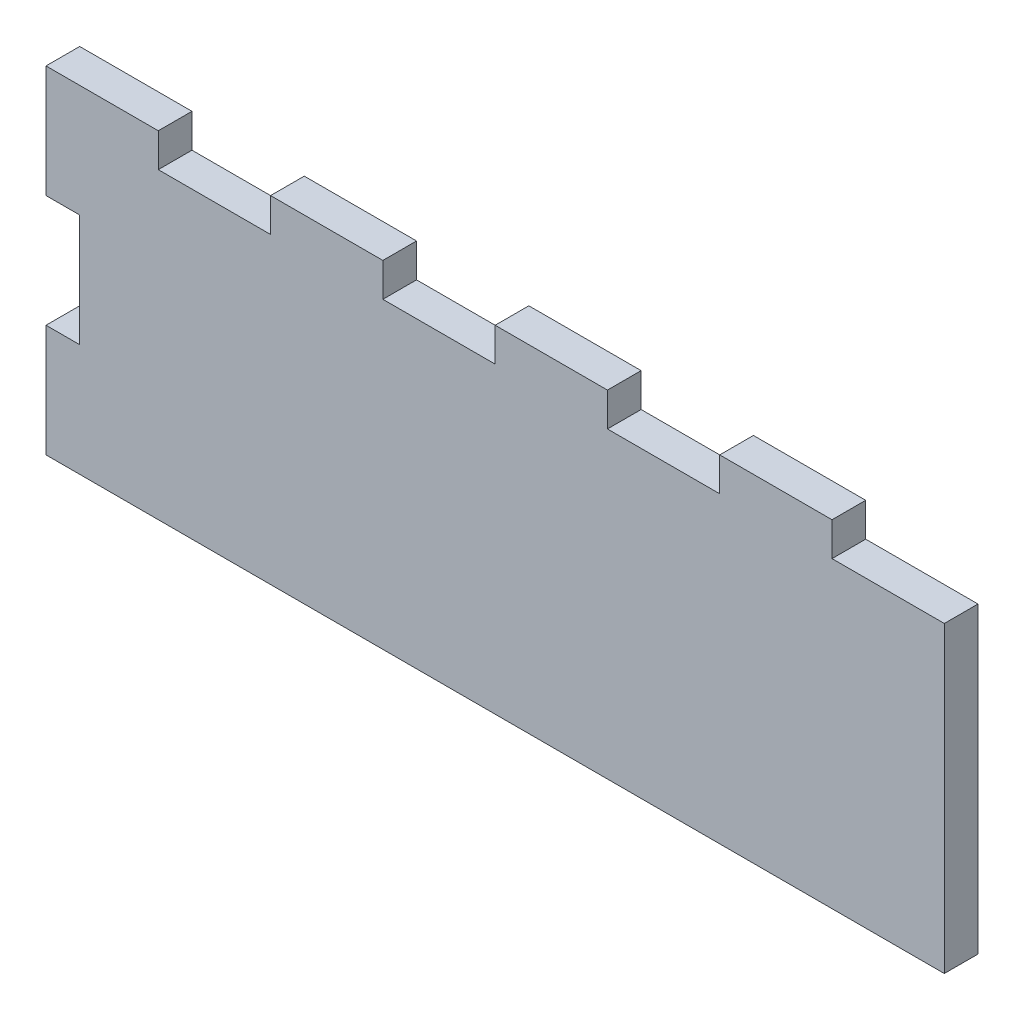
ISO-10303-21;
HEADER;
FILE_DESCRIPTION(('STEP AP214'),'2;1');
FILE_NAME('part.step','',(''),(''),'','','');
FILE_SCHEMA(('AUTOMOTIVE_DESIGN { 1 0 10303 214 1 1 1 1 }'));
ENDSEC;
DATA;
#1=APPLICATION_CONTEXT('core data for automotive mechanical design processes');
#2=APPLICATION_PROTOCOL_DEFINITION('international standard','automotive_design',2000,#1);
#3=PRODUCT_CONTEXT('',#1,'mechanical');
#4=PRODUCT('Part','Part','',(#3));
#5=PRODUCT_RELATED_PRODUCT_CATEGORY('part','',(#4));
#6=PRODUCT_DEFINITION_FORMATION('','',#4);
#7=PRODUCT_DEFINITION_CONTEXT('part definition',#1,'design');
#8=PRODUCT_DEFINITION('design','',#6,#7);
#9=PRODUCT_DEFINITION_SHAPE('','',#8);
#10=(LENGTH_UNIT() NAMED_UNIT(*) SI_UNIT(.MILLI.,.METRE.));
#11=(NAMED_UNIT(*) PLANE_ANGLE_UNIT() SI_UNIT($,.RADIAN.));
#12=(NAMED_UNIT(*) SI_UNIT($,.STERADIAN.) SOLID_ANGLE_UNIT());
#13=UNCERTAINTY_MEASURE_WITH_UNIT(LENGTH_MEASURE(1.E-05),#10,'distance_accuracy_value','');
#14=(GEOMETRIC_REPRESENTATION_CONTEXT(3) GLOBAL_UNCERTAINTY_ASSIGNED_CONTEXT((#13)) GLOBAL_UNIT_ASSIGNED_CONTEXT((#10,
#11,#12)) REPRESENTATION_CONTEXT('',''));
#15=CARTESIAN_POINT('',(0.,0.,0.));
#16=DIRECTION('',(0.,0.,1.));
#17=DIRECTION('',(1.,0.,0.));
#18=AXIS2_PLACEMENT_3D('',#15,#16,#17);
#19=CARTESIAN_POINT('',(0.,0.,3.));
#20=DIRECTION('',(1.,0.,0.));
#21=DIRECTION('',(0.,1.,0.));
#22=AXIS2_PLACEMENT_3D('',#19,#20,#21);
#23=PLANE('',#22);
#24=DIRECTION('',(0.,-1.,0.));
#25=VECTOR('',#24,1.);
#26=CARTESIAN_POINT('',(0.,0.,3.));
#27=LINE('',#26,#25);
#28=CARTESIAN_POINT('',(0.,-20.,3.));
#29=VERTEX_POINT('',#28);
#30=CARTESIAN_POINT('',(0.,-30.,3.));
#31=VERTEX_POINT('',#30);
#32=EDGE_CURVE('E207',#29,#31,#27,.T.);
#33=ORIENTED_EDGE('',*,*,#32,.F.);
#34=DIRECTION('',(0.,0.,-1.));
#35=VECTOR('',#34,1.);
#36=CARTESIAN_POINT('',(0.,-20.,3.));
#37=LINE('',#36,#35);
#38=CARTESIAN_POINT('',(0.,-20.,0.));
#39=VERTEX_POINT('',#38);
#40=EDGE_CURVE('E278',#29,#39,#37,.T.);
#41=ORIENTED_EDGE('',*,*,#40,.T.);
#42=DIRECTION('',(0.,-1.,0.));
#43=VECTOR('',#42,1.);
#44=CARTESIAN_POINT('',(0.,0.,0.));
#45=LINE('',#44,#43);
#46=CARTESIAN_POINT('',(0.,-30.,0.));
#47=VERTEX_POINT('',#46);
#48=EDGE_CURVE('E225',#39,#47,#45,.T.);
#49=ORIENTED_EDGE('',*,*,#48,.T.);
#50=DIRECTION('',(0.,0.,-1.));
#51=VECTOR('',#50,1.);
#52=CARTESIAN_POINT('',(0.,-30.,3.));
#53=LINE('',#52,#51);
#54=EDGE_CURVE('E11',#31,#47,#53,.T.);
#55=ORIENTED_EDGE('',*,*,#54,.F.);
#56=EDGE_LOOP('',(#33,#41,#49,#55));
#57=FACE_BOUND('',#56,.T.);
#58=ADVANCED_FACE('F33',(#57),#23,.F.);
#59=CARTESIAN_POINT('',(0.,0.,3.));
#60=DIRECTION('',(0.,-1.,0.));
#61=DIRECTION('',(0.,0.,-1.));
#62=AXIS2_PLACEMENT_3D('',#59,#60,#61);
#63=PLANE('',#62);
#64=DIRECTION('',(-1.,0.,0.));
#65=VECTOR('',#64,1.);
#66=CARTESIAN_POINT('',(0.,0.,0.));
#67=LINE('',#66,#65);
#68=CARTESIAN_POINT('',(70.,0.,0.));
#69=VERTEX_POINT('',#68);
#70=CARTESIAN_POINT('',(60.,0.,0.));
#71=VERTEX_POINT('',#70);
#72=EDGE_CURVE('E211',#69,#71,#67,.T.);
#73=ORIENTED_EDGE('',*,*,#72,.T.);
#74=DIRECTION('',(0.,0.,1.));
#75=VECTOR('',#74,1.);
#76=CARTESIAN_POINT('',(60.,0.,0.));
#77=LINE('',#76,#75);
#78=CARTESIAN_POINT('',(60.,0.,3.));
#79=VERTEX_POINT('',#78);
#80=EDGE_CURVE('E302',#71,#79,#77,.T.);
#81=ORIENTED_EDGE('',*,*,#80,.T.);
#82=DIRECTION('',(-1.,0.,0.));
#83=VECTOR('',#82,1.);
#84=CARTESIAN_POINT('',(0.,0.,3.));
#85=LINE('',#84,#83);
#86=CARTESIAN_POINT('',(70.,0.,3.));
#87=VERTEX_POINT('',#86);
#88=EDGE_CURVE('E218',#87,#79,#85,.T.);
#89=ORIENTED_EDGE('',*,*,#88,.F.);
#90=DIRECTION('',(0.,0.,1.));
#91=VECTOR('',#90,1.);
#92=CARTESIAN_POINT('',(70.,0.,0.));
#93=LINE('',#92,#91);
#94=EDGE_CURVE('E213',#69,#87,#93,.T.);
#95=ORIENTED_EDGE('',*,*,#94,.F.);
#96=EDGE_LOOP('',(#73,#81,#89,#95));
#97=FACE_BOUND('',#96,.T.);
#98=ADVANCED_FACE('F422',(#97),#63,.F.);
#99=CARTESIAN_POINT('',(50.,0.,3.));
#100=VERTEX_POINT('',#99);
#101=CARTESIAN_POINT('',(40.,0.,3.));
#102=VERTEX_POINT('',#101);
#103=EDGE_CURVE('E222',#100,#102,#85,.T.);
#104=ORIENTED_EDGE('',*,*,#103,.F.);
#105=DIRECTION('',(0.,0.,1.));
#106=VECTOR('',#105,1.);
#107=CARTESIAN_POINT('',(50.,0.,0.));
#108=LINE('',#107,#106);
#109=CARTESIAN_POINT('',(50.,0.,0.));
#110=VERTEX_POINT('',#109);
#111=EDGE_CURVE('E314',#110,#100,#108,.T.);
#112=ORIENTED_EDGE('',*,*,#111,.F.);
#113=CARTESIAN_POINT('',(40.,0.,0.));
#114=VERTEX_POINT('',#113);
#115=EDGE_CURVE('E233',#110,#114,#67,.T.);
#116=ORIENTED_EDGE('',*,*,#115,.T.);
#117=DIRECTION('',(0.,0.,1.));
#118=VECTOR('',#117,1.);
#119=CARTESIAN_POINT('',(40.,0.,0.));
#120=LINE('',#119,#118);
#121=EDGE_CURVE('E328',#114,#102,#120,.T.);
#122=ORIENTED_EDGE('',*,*,#121,.T.);
#123=EDGE_LOOP('',(#104,#112,#116,#122));
#124=FACE_BOUND('',#123,.T.);
#125=ADVANCED_FACE('F388',(#124),#63,.F.);
#126=CARTESIAN_POINT('',(30.,0.,3.));
#127=VERTEX_POINT('',#126);
#128=CARTESIAN_POINT('',(20.,0.,3.));
#129=VERTEX_POINT('',#128);
#130=EDGE_CURVE('E372',#127,#129,#85,.T.);
#131=ORIENTED_EDGE('',*,*,#130,.F.);
#132=DIRECTION('',(0.,0.,1.));
#133=VECTOR('',#132,1.);
#134=CARTESIAN_POINT('',(30.,0.,0.));
#135=LINE('',#134,#133);
#136=CARTESIAN_POINT('',(30.,0.,0.));
#137=VERTEX_POINT('',#136);
#138=EDGE_CURVE('E340',#137,#127,#135,.T.);
#139=ORIENTED_EDGE('',*,*,#138,.F.);
#140=CARTESIAN_POINT('',(20.,0.,0.));
#141=VERTEX_POINT('',#140);
#142=EDGE_CURVE('E374',#137,#141,#67,.T.);
#143=ORIENTED_EDGE('',*,*,#142,.T.);
#144=DIRECTION('',(0.,0.,1.));
#145=VECTOR('',#144,1.);
#146=CARTESIAN_POINT('',(20.,0.,0.));
#147=LINE('',#146,#145);
#148=EDGE_CURVE('E354',#141,#129,#147,.T.);
#149=ORIENTED_EDGE('',*,*,#148,.T.);
#150=EDGE_LOOP('',(#131,#139,#143,#149));
#151=FACE_BOUND('',#150,.T.);
#152=ADVANCED_FACE('F370',(#151),#63,.F.);
#153=CARTESIAN_POINT('',(0.,0.,0.));
#154=VERTEX_POINT('',#153);
#155=CARTESIAN_POINT('',(0.,-10.,0.));
#156=VERTEX_POINT('',#155);
#157=EDGE_CURVE('E197',#154,#156,#45,.T.);
#158=ORIENTED_EDGE('',*,*,#157,.T.);
#159=DIRECTION('',(0.,0.,-1.));
#160=VECTOR('',#159,1.);
#161=CARTESIAN_POINT('',(0.,-10.,3.));
#162=LINE('',#161,#160);
#163=CARTESIAN_POINT('',(0.,-10.,3.));
#164=VERTEX_POINT('',#163);
#165=EDGE_CURVE('E48',#164,#156,#162,.T.);
#166=ORIENTED_EDGE('',*,*,#165,.F.);
#167=CARTESIAN_POINT('',(0.,0.,3.));
#168=VERTEX_POINT('',#167);
#169=EDGE_CURVE('E195',#168,#164,#27,.T.);
#170=ORIENTED_EDGE('',*,*,#169,.F.);
#171=DIRECTION('',(0.,0.,-1.));
#172=VECTOR('',#171,1.);
#173=CARTESIAN_POINT('',(0.,0.,3.));
#174=LINE('',#173,#172);
#175=EDGE_CURVE('E221',#168,#154,#174,.T.);
#176=ORIENTED_EDGE('',*,*,#175,.T.);
#177=EDGE_LOOP('',(#158,#166,#170,#176));
#178=FACE_BOUND('',#177,.T.);
#179=ADVANCED_FACE('F35',(#178),#23,.F.);
#180=CARTESIAN_POINT('',(0.,-30.,3.));
#181=DIRECTION('',(0.,1.,0.));
#182=DIRECTION('',(0.,0.,1.));
#183=AXIS2_PLACEMENT_3D('',#180,#181,#182);
#184=PLANE('',#183);
#185=DIRECTION('',(1.,0.,0.));
#186=VECTOR('',#185,1.);
#187=CARTESIAN_POINT('',(0.,-30.,0.));
#188=LINE('',#187,#186);
#189=CARTESIAN_POINT('',(80.,-30.,0.));
#190=VERTEX_POINT('',#189);
#191=EDGE_CURVE('E224',#47,#190,#188,.T.);
#192=ORIENTED_EDGE('',*,*,#191,.T.);
#193=DIRECTION('',(0.,0.,-1.));
#194=VECTOR('',#193,1.);
#195=CARTESIAN_POINT('',(80.,-30.,3.));
#196=LINE('',#195,#194);
#197=CARTESIAN_POINT('',(80.,-30.,3.));
#198=VERTEX_POINT('',#197);
#199=EDGE_CURVE('E41',#198,#190,#196,.T.);
#200=ORIENTED_EDGE('',*,*,#199,.F.);
#201=DIRECTION('',(1.,0.,0.));
#202=VECTOR('',#201,1.);
#203=CARTESIAN_POINT('',(0.,-30.,3.));
#204=LINE('',#203,#202);
#205=EDGE_CURVE('E206',#31,#198,#204,.T.);
#206=ORIENTED_EDGE('',*,*,#205,.F.);
#207=ORIENTED_EDGE('',*,*,#54,.T.);
#208=EDGE_LOOP('',(#192,#200,#206,#207));
#209=FACE_BOUND('',#208,.T.);
#210=ADVANCED_FACE('F275',(#209),#184,.F.);
#211=CARTESIAN_POINT('',(80.,0.,3.));
#212=DIRECTION('',(-1.,0.,0.));
#213=DIRECTION('',(0.,0.,1.));
#214=AXIS2_PLACEMENT_3D('',#211,#212,#213);
#215=PLANE('',#214);
#216=DIRECTION('',(0.,1.,0.));
#217=VECTOR('',#216,1.);
#218=CARTESIAN_POINT('',(80.,0.,0.));
#219=LINE('',#218,#217);
#220=CARTESIAN_POINT('',(80.,-3.,0.));
#221=VERTEX_POINT('',#220);
#222=EDGE_CURVE('E227',#190,#221,#219,.T.);
#223=ORIENTED_EDGE('',*,*,#222,.T.);
#224=DIRECTION('',(0.,0.,1.));
#225=VECTOR('',#224,1.);
#226=CARTESIAN_POINT('',(80.,-3.,0.));
#227=LINE('',#226,#225);
#228=CARTESIAN_POINT('',(80.,-3.,3.));
#229=VERTEX_POINT('',#228);
#230=EDGE_CURVE('E265',#221,#229,#227,.T.);
#231=ORIENTED_EDGE('',*,*,#230,.T.);
#232=DIRECTION('',(0.,1.,0.));
#233=VECTOR('',#232,1.);
#234=CARTESIAN_POINT('',(80.,0.,3.));
#235=LINE('',#234,#233);
#236=EDGE_CURVE('E209',#198,#229,#235,.T.);
#237=ORIENTED_EDGE('',*,*,#236,.F.);
#238=ORIENTED_EDGE('',*,*,#199,.T.);
#239=EDGE_LOOP('',(#223,#231,#237,#238));
#240=FACE_BOUND('',#239,.T.);
#241=ADVANCED_FACE('F239',(#240),#215,.F.);
#242=CARTESIAN_POINT('',(10.,0.,3.));
#243=VERTEX_POINT('',#242);
#244=EDGE_CURVE('E204',#243,#168,#85,.T.);
#245=ORIENTED_EDGE('',*,*,#244,.F.);
#246=DIRECTION('',(0.,0.,1.));
#247=VECTOR('',#246,1.);
#248=CARTESIAN_POINT('',(10.,0.,0.));
#249=LINE('',#248,#247);
#250=CARTESIAN_POINT('',(10.,0.,0.));
#251=VERTEX_POINT('',#250);
#252=EDGE_CURVE('E364',#251,#243,#249,.T.);
#253=ORIENTED_EDGE('',*,*,#252,.F.);
#254=EDGE_CURVE('E230',#251,#154,#67,.T.);
#255=ORIENTED_EDGE('',*,*,#254,.T.);
#256=ORIENTED_EDGE('',*,*,#175,.F.);
#257=EDGE_LOOP('',(#245,#253,#255,#256));
#258=FACE_BOUND('',#257,.T.);
#259=ADVANCED_FACE('F402',(#258),#63,.F.);
#260=CARTESIAN_POINT('',(0.,0.,3.));
#261=DIRECTION('',(0.,0.,1.));
#262=DIRECTION('',(1.,0.,0.));
#263=AXIS2_PLACEMENT_3D('',#260,#261,#262);
#264=PLANE('',#263);
#265=DIRECTION('',(-1.,0.,0.));
#266=VECTOR('',#265,1.);
#267=CARTESIAN_POINT('',(0.,-20.,3.));
#268=LINE('',#267,#266);
#269=CARTESIAN_POINT('',(3.,-20.,3.));
#270=VERTEX_POINT('',#269);
#271=EDGE_CURVE('E198',#270,#29,#268,.T.);
#272=ORIENTED_EDGE('',*,*,#271,.T.);
#273=ORIENTED_EDGE('',*,*,#32,.T.);
#274=ORIENTED_EDGE('',*,*,#205,.T.);
#275=ORIENTED_EDGE('',*,*,#236,.T.);
#276=DIRECTION('',(1.,0.,0.));
#277=VECTOR('',#276,1.);
#278=CARTESIAN_POINT('',(80.,-3.,3.));
#279=LINE('',#278,#277);
#280=CARTESIAN_POINT('',(70.,-3.,3.));
#281=VERTEX_POINT('',#280);
#282=EDGE_CURVE('E256',#281,#229,#279,.T.);
#283=ORIENTED_EDGE('',*,*,#282,.F.);
#284=DIRECTION('',(0.,-1.,0.));
#285=VECTOR('',#284,1.);
#286=CARTESIAN_POINT('',(70.,0.,3.));
#287=LINE('',#286,#285);
#288=EDGE_CURVE('E260',#87,#281,#287,.T.);
#289=ORIENTED_EDGE('',*,*,#288,.F.);
#290=ORIENTED_EDGE('',*,*,#88,.T.);
#291=DIRECTION('',(0.,1.,0.));
#292=VECTOR('',#291,1.);
#293=CARTESIAN_POINT('',(60.,0.,3.));
#294=LINE('',#293,#292);
#295=CARTESIAN_POINT('',(60.,-3.,3.));
#296=VERTEX_POINT('',#295);
#297=EDGE_CURVE('E303',#296,#79,#294,.T.);
#298=ORIENTED_EDGE('',*,*,#297,.F.);
#299=DIRECTION('',(1.,0.,0.));
#300=VECTOR('',#299,1.);
#301=CARTESIAN_POINT('',(60.,-3.,3.));
#302=LINE('',#301,#300);
#303=CARTESIAN_POINT('',(50.,-3.,3.));
#304=VERTEX_POINT('',#303);
#305=EDGE_CURVE('E298',#304,#296,#302,.T.);
#306=ORIENTED_EDGE('',*,*,#305,.F.);
#307=DIRECTION('',(0.,-1.,0.));
#308=VECTOR('',#307,1.);
#309=CARTESIAN_POINT('',(50.,0.,3.));
#310=LINE('',#309,#308);
#311=EDGE_CURVE('E305',#100,#304,#310,.T.);
#312=ORIENTED_EDGE('',*,*,#311,.F.);
#313=ORIENTED_EDGE('',*,*,#103,.T.);
#314=DIRECTION('',(0.,1.,0.));
#315=VECTOR('',#314,1.);
#316=CARTESIAN_POINT('',(40.,0.,3.));
#317=LINE('',#316,#315);
#318=CARTESIAN_POINT('',(40.,-3.,3.));
#319=VERTEX_POINT('',#318);
#320=EDGE_CURVE('E329',#319,#102,#317,.T.);
#321=ORIENTED_EDGE('',*,*,#320,.F.);
#322=DIRECTION('',(1.,0.,0.));
#323=VECTOR('',#322,1.);
#324=CARTESIAN_POINT('',(40.,-3.,3.));
#325=LINE('',#324,#323);
#326=CARTESIAN_POINT('',(30.,-3.,3.));
#327=VERTEX_POINT('',#326);
#328=EDGE_CURVE('E322',#327,#319,#325,.T.);
#329=ORIENTED_EDGE('',*,*,#328,.F.);
#330=DIRECTION('',(0.,-1.,0.));
#331=VECTOR('',#330,1.);
#332=CARTESIAN_POINT('',(30.,0.,3.));
#333=LINE('',#332,#331);
#334=EDGE_CURVE('E331',#127,#327,#333,.T.);
#335=ORIENTED_EDGE('',*,*,#334,.F.);
#336=ORIENTED_EDGE('',*,*,#130,.T.);
#337=DIRECTION('',(0.,1.,0.));
#338=VECTOR('',#337,1.);
#339=CARTESIAN_POINT('',(20.,0.,3.));
#340=LINE('',#339,#338);
#341=CARTESIAN_POINT('',(20.,-3.,3.));
#342=VERTEX_POINT('',#341);
#343=EDGE_CURVE('E290',#342,#129,#340,.T.);
#344=ORIENTED_EDGE('',*,*,#343,.F.);
#345=DIRECTION('',(1.,0.,0.));
#346=VECTOR('',#345,1.);
#347=CARTESIAN_POINT('',(20.,-3.,3.));
#348=LINE('',#347,#346);
#349=CARTESIAN_POINT('',(10.,-3.,3.));
#350=VERTEX_POINT('',#349);
#351=EDGE_CURVE('E348',#350,#342,#348,.T.);
#352=ORIENTED_EDGE('',*,*,#351,.F.);
#353=DIRECTION('',(0.,-1.,0.));
#354=VECTOR('',#353,1.);
#355=CARTESIAN_POINT('',(10.,0.,3.));
#356=LINE('',#355,#354);
#357=EDGE_CURVE('E356',#243,#350,#356,.T.);
#358=ORIENTED_EDGE('',*,*,#357,.F.);
#359=ORIENTED_EDGE('',*,*,#244,.T.);
#360=ORIENTED_EDGE('',*,*,#169,.T.);
#361=DIRECTION('',(1.,0.,0.));
#362=VECTOR('',#361,1.);
#363=CARTESIAN_POINT('',(0.,-10.,3.));
#364=LINE('',#363,#362);
#365=CARTESIAN_POINT('',(3.,-10.,3.));
#366=VERTEX_POINT('',#365);
#367=EDGE_CURVE('E181',#164,#366,#364,.T.);
#368=ORIENTED_EDGE('',*,*,#367,.T.);
#369=DIRECTION('',(0.,-1.,0.));
#370=VECTOR('',#369,1.);
#371=CARTESIAN_POINT('',(3.,-20.,3.));
#372=LINE('',#371,#370);
#373=EDGE_CURVE('E188',#366,#270,#372,.T.);
#374=ORIENTED_EDGE('',*,*,#373,.T.);
#375=EDGE_LOOP('',(#272,#273,#274,#275,#283,#289,#290,#298,#306,#312,#313,#321,#329,#335,#336,
#344,#352,#358,#359,#360,#368,#374));
#376=FACE_BOUND('',#375,.T.);
#377=ADVANCED_FACE('F201',(#376),#264,.T.);
#378=CARTESIAN_POINT('',(0.,0.,0.));
#379=DIRECTION('',(0.,0.,1.));
#380=DIRECTION('',(1.,0.,0.));
#381=AXIS2_PLACEMENT_3D('',#378,#379,#380);
#382=PLANE('',#381);
#383=ORIENTED_EDGE('',*,*,#48,.F.);
#384=DIRECTION('',(-1.,0.,0.));
#385=VECTOR('',#384,1.);
#386=CARTESIAN_POINT('',(0.,-20.,0.));
#387=LINE('',#386,#385);
#388=CARTESIAN_POINT('',(3.,-20.,0.));
#389=VERTEX_POINT('',#388);
#390=EDGE_CURVE('E189',#389,#39,#387,.T.);
#391=ORIENTED_EDGE('',*,*,#390,.F.);
#392=DIRECTION('',(0.,-1.,0.));
#393=VECTOR('',#392,1.);
#394=CARTESIAN_POINT('',(3.,-20.,0.));
#395=LINE('',#394,#393);
#396=CARTESIAN_POINT('',(3.,-10.,0.));
#397=VERTEX_POINT('',#396);
#398=EDGE_CURVE('E282',#397,#389,#395,.T.);
#399=ORIENTED_EDGE('',*,*,#398,.F.);
#400=DIRECTION('',(1.,0.,0.));
#401=VECTOR('',#400,1.);
#402=CARTESIAN_POINT('',(0.,-10.,0.));
#403=LINE('',#402,#401);
#404=EDGE_CURVE('E285',#156,#397,#403,.T.);
#405=ORIENTED_EDGE('',*,*,#404,.F.);
#406=ORIENTED_EDGE('',*,*,#157,.F.);
#407=ORIENTED_EDGE('',*,*,#254,.F.);
#408=DIRECTION('',(0.,-1.,0.));
#409=VECTOR('',#408,1.);
#410=CARTESIAN_POINT('',(10.,0.,0.));
#411=LINE('',#410,#409);
#412=CARTESIAN_POINT('',(10.,-3.,0.));
#413=VERTEX_POINT('',#412);
#414=EDGE_CURVE('E347',#251,#413,#411,.T.);
#415=ORIENTED_EDGE('',*,*,#414,.T.);
#416=DIRECTION('',(1.,0.,0.));
#417=VECTOR('',#416,1.);
#418=CARTESIAN_POINT('',(20.,-3.,0.));
#419=LINE('',#418,#417);
#420=CARTESIAN_POINT('',(20.,-3.,0.));
#421=VERTEX_POINT('',#420);
#422=EDGE_CURVE('E351',#413,#421,#419,.T.);
#423=ORIENTED_EDGE('',*,*,#422,.T.);
#424=DIRECTION('',(0.,1.,0.));
#425=VECTOR('',#424,1.);
#426=CARTESIAN_POINT('',(20.,0.,0.));
#427=LINE('',#426,#425);
#428=EDGE_CURVE('E344',#421,#141,#427,.T.);
#429=ORIENTED_EDGE('',*,*,#428,.T.);
#430=ORIENTED_EDGE('',*,*,#142,.F.);
#431=DIRECTION('',(0.,-1.,0.));
#432=VECTOR('',#431,1.);
#433=CARTESIAN_POINT('',(30.,0.,0.));
#434=LINE('',#433,#432);
#435=CARTESIAN_POINT('',(30.,-3.,0.));
#436=VERTEX_POINT('',#435);
#437=EDGE_CURVE('E321',#137,#436,#434,.T.);
#438=ORIENTED_EDGE('',*,*,#437,.T.);
#439=DIRECTION('',(1.,0.,0.));
#440=VECTOR('',#439,1.);
#441=CARTESIAN_POINT('',(40.,-3.,0.));
#442=LINE('',#441,#440);
#443=CARTESIAN_POINT('',(40.,-3.,0.));
#444=VERTEX_POINT('',#443);
#445=EDGE_CURVE('E325',#436,#444,#442,.T.);
#446=ORIENTED_EDGE('',*,*,#445,.T.);
#447=DIRECTION('',(0.,1.,0.));
#448=VECTOR('',#447,1.);
#449=CARTESIAN_POINT('',(40.,0.,0.));
#450=LINE('',#449,#448);
#451=EDGE_CURVE('E318',#444,#114,#450,.T.);
#452=ORIENTED_EDGE('',*,*,#451,.T.);
#453=ORIENTED_EDGE('',*,*,#115,.F.);
#454=DIRECTION('',(0.,-1.,0.));
#455=VECTOR('',#454,1.);
#456=CARTESIAN_POINT('',(50.,0.,0.));
#457=LINE('',#456,#455);
#458=CARTESIAN_POINT('',(50.,-3.,0.));
#459=VERTEX_POINT('',#458);
#460=EDGE_CURVE('E297',#110,#459,#457,.T.);
#461=ORIENTED_EDGE('',*,*,#460,.T.);
#462=DIRECTION('',(1.,0.,0.));
#463=VECTOR('',#462,1.);
#464=CARTESIAN_POINT('',(60.,-3.,0.));
#465=LINE('',#464,#463);
#466=CARTESIAN_POINT('',(60.,-3.,0.));
#467=VERTEX_POINT('',#466);
#468=EDGE_CURVE('E56',#459,#467,#465,.T.);
#469=ORIENTED_EDGE('',*,*,#468,.T.);
#470=DIRECTION('',(0.,1.,0.));
#471=VECTOR('',#470,1.);
#472=CARTESIAN_POINT('',(60.,0.,0.));
#473=LINE('',#472,#471);
#474=EDGE_CURVE('E294',#467,#71,#473,.T.);
#475=ORIENTED_EDGE('',*,*,#474,.T.);
#476=ORIENTED_EDGE('',*,*,#72,.F.);
#477=DIRECTION('',(0.,-1.,0.));
#478=VECTOR('',#477,1.);
#479=CARTESIAN_POINT('',(70.,0.,0.));
#480=LINE('',#479,#478);
#481=CARTESIAN_POINT('',(70.,-3.,0.));
#482=VERTEX_POINT('',#481);
#483=EDGE_CURVE('E251',#69,#482,#480,.T.);
#484=ORIENTED_EDGE('',*,*,#483,.T.);
#485=DIRECTION('',(1.,0.,0.));
#486=VECTOR('',#485,1.);
#487=CARTESIAN_POINT('',(80.,-3.,0.));
#488=LINE('',#487,#486);
#489=EDGE_CURVE('E249',#482,#221,#488,.T.);
#490=ORIENTED_EDGE('',*,*,#489,.T.);
#491=ORIENTED_EDGE('',*,*,#222,.F.);
#492=ORIENTED_EDGE('',*,*,#191,.F.);
#493=EDGE_LOOP('',(#383,#391,#399,#405,#406,#407,#415,#423,#429,#430,#438,#446,#452,#453,#461,
#469,#475,#476,#484,#490,#491,#492));
#494=FACE_BOUND('',#493,.T.);
#495=ADVANCED_FACE('F247',(#494),#382,.F.);
#496=CARTESIAN_POINT('',(80.,-3.,0.));
#497=DIRECTION('',(0.,-1.,0.));
#498=DIRECTION('',(1.,0.,0.));
#499=AXIS2_PLACEMENT_3D('',#496,#497,#498);
#500=PLANE('',#499);
#501=ORIENTED_EDGE('',*,*,#282,.T.);
#502=ORIENTED_EDGE('',*,*,#230,.F.);
#503=ORIENTED_EDGE('',*,*,#489,.F.);
#504=DIRECTION('',(0.,0.,1.));
#505=VECTOR('',#504,1.);
#506=CARTESIAN_POINT('',(70.,-3.,0.));
#507=LINE('',#506,#505);
#508=EDGE_CURVE('E255',#482,#281,#507,.T.);
#509=ORIENTED_EDGE('',*,*,#508,.T.);
#510=EDGE_LOOP('',(#501,#502,#503,#509));
#511=FACE_BOUND('',#510,.T.);
#512=ADVANCED_FACE('F266',(#511),#500,.F.);
#513=CARTESIAN_POINT('',(70.,0.,0.));
#514=DIRECTION('',(-1.,0.,0.));
#515=DIRECTION('',(0.,0.,1.));
#516=AXIS2_PLACEMENT_3D('',#513,#514,#515);
#517=PLANE('',#516);
#518=ORIENTED_EDGE('',*,*,#288,.T.);
#519=ORIENTED_EDGE('',*,*,#508,.F.);
#520=ORIENTED_EDGE('',*,*,#483,.F.);
#521=ORIENTED_EDGE('',*,*,#94,.T.);
#522=EDGE_LOOP('',(#518,#519,#520,#521));
#523=FACE_BOUND('',#522,.T.);
#524=ADVANCED_FACE('F270',(#523),#517,.F.);
#525=CARTESIAN_POINT('',(20.,0.,0.));
#526=DIRECTION('',(1.,0.,0.));
#527=DIRECTION('',(0.,0.,-1.));
#528=AXIS2_PLACEMENT_3D('',#525,#526,#527);
#529=PLANE('',#528);
#530=ORIENTED_EDGE('',*,*,#343,.T.);
#531=ORIENTED_EDGE('',*,*,#148,.F.);
#532=ORIENTED_EDGE('',*,*,#428,.F.);
#533=DIRECTION('',(0.,0.,1.));
#534=VECTOR('',#533,1.);
#535=CARTESIAN_POINT('',(20.,-3.,0.));
#536=LINE('',#535,#534);
#537=EDGE_CURVE('E332',#421,#342,#536,.T.);
#538=ORIENTED_EDGE('',*,*,#537,.T.);
#539=EDGE_LOOP('',(#530,#531,#532,#538));
#540=FACE_BOUND('',#539,.T.);
#541=ADVANCED_FACE('F490',(#540),#529,.F.);
#542=CARTESIAN_POINT('',(20.,-3.,0.));
#543=DIRECTION('',(0.,-1.,0.));
#544=DIRECTION('',(1.,0.,0.));
#545=AXIS2_PLACEMENT_3D('',#542,#543,#544);
#546=PLANE('',#545);
#547=ORIENTED_EDGE('',*,*,#351,.T.);
#548=ORIENTED_EDGE('',*,*,#537,.F.);
#549=ORIENTED_EDGE('',*,*,#422,.F.);
#550=DIRECTION('',(0.,0.,1.));
#551=VECTOR('',#550,1.);
#552=CARTESIAN_POINT('',(10.,-3.,0.));
#553=LINE('',#552,#551);
#554=EDGE_CURVE('E362',#413,#350,#553,.T.);
#555=ORIENTED_EDGE('',*,*,#554,.T.);
#556=EDGE_LOOP('',(#547,#548,#549,#555));
#557=FACE_BOUND('',#556,.T.);
#558=ADVANCED_FACE('F511',(#557),#546,.F.);
#559=CARTESIAN_POINT('',(10.,0.,0.));
#560=DIRECTION('',(-1.,0.,0.));
#561=DIRECTION('',(0.,0.,1.));
#562=AXIS2_PLACEMENT_3D('',#559,#560,#561);
#563=PLANE('',#562);
#564=ORIENTED_EDGE('',*,*,#357,.T.);
#565=ORIENTED_EDGE('',*,*,#554,.F.);
#566=ORIENTED_EDGE('',*,*,#414,.F.);
#567=ORIENTED_EDGE('',*,*,#252,.T.);
#568=EDGE_LOOP('',(#564,#565,#566,#567));
#569=FACE_BOUND('',#568,.T.);
#570=ADVANCED_FACE('F519',(#569),#563,.F.);
#571=CARTESIAN_POINT('',(40.,0.,0.));
#572=DIRECTION('',(1.,0.,0.));
#573=DIRECTION('',(0.,0.,-1.));
#574=AXIS2_PLACEMENT_3D('',#571,#572,#573);
#575=PLANE('',#574);
#576=ORIENTED_EDGE('',*,*,#320,.T.);
#577=ORIENTED_EDGE('',*,*,#121,.F.);
#578=ORIENTED_EDGE('',*,*,#451,.F.);
#579=DIRECTION('',(0.,0.,1.));
#580=VECTOR('',#579,1.);
#581=CARTESIAN_POINT('',(40.,-3.,0.));
#582=LINE('',#581,#580);
#583=EDGE_CURVE('E306',#444,#319,#582,.T.);
#584=ORIENTED_EDGE('',*,*,#583,.T.);
#585=EDGE_LOOP('',(#576,#577,#578,#584));
#586=FACE_BOUND('',#585,.T.);
#587=ADVANCED_FACE('F393',(#586),#575,.F.);
#588=CARTESIAN_POINT('',(40.,-3.,0.));
#589=DIRECTION('',(0.,-1.,0.));
#590=DIRECTION('',(1.,0.,0.));
#591=AXIS2_PLACEMENT_3D('',#588,#589,#590);
#592=PLANE('',#591);
#593=ORIENTED_EDGE('',*,*,#328,.T.);
#594=ORIENTED_EDGE('',*,*,#583,.F.);
#595=ORIENTED_EDGE('',*,*,#445,.F.);
#596=DIRECTION('',(0.,0.,1.));
#597=VECTOR('',#596,1.);
#598=CARTESIAN_POINT('',(30.,-3.,0.));
#599=LINE('',#598,#597);
#600=EDGE_CURVE('E338',#436,#327,#599,.T.);
#601=ORIENTED_EDGE('',*,*,#600,.T.);
#602=EDGE_LOOP('',(#593,#594,#595,#601));
#603=FACE_BOUND('',#602,.T.);
#604=ADVANCED_FACE('F396',(#603),#592,.F.);
#605=CARTESIAN_POINT('',(30.,0.,0.));
#606=DIRECTION('',(-1.,0.,0.));
#607=DIRECTION('',(0.,0.,1.));
#608=AXIS2_PLACEMENT_3D('',#605,#606,#607);
#609=PLANE('',#608);
#610=ORIENTED_EDGE('',*,*,#334,.T.);
#611=ORIENTED_EDGE('',*,*,#600,.F.);
#612=ORIENTED_EDGE('',*,*,#437,.F.);
#613=ORIENTED_EDGE('',*,*,#138,.T.);
#614=EDGE_LOOP('',(#610,#611,#612,#613));
#615=FACE_BOUND('',#614,.T.);
#616=ADVANCED_FACE('F398',(#615),#609,.F.);
#617=CARTESIAN_POINT('',(60.,0.,0.));
#618=DIRECTION('',(1.,0.,0.));
#619=DIRECTION('',(0.,0.,-1.));
#620=AXIS2_PLACEMENT_3D('',#617,#618,#619);
#621=PLANE('',#620);
#622=ORIENTED_EDGE('',*,*,#297,.T.);
#623=ORIENTED_EDGE('',*,*,#80,.F.);
#624=ORIENTED_EDGE('',*,*,#474,.F.);
#625=DIRECTION('',(0.,0.,1.));
#626=VECTOR('',#625,1.);
#627=CARTESIAN_POINT('',(60.,-3.,0.));
#628=LINE('',#627,#626);
#629=EDGE_CURVE('E263',#467,#296,#628,.T.);
#630=ORIENTED_EDGE('',*,*,#629,.T.);
#631=EDGE_LOOP('',(#622,#623,#624,#630));
#632=FACE_BOUND('',#631,.T.);
#633=ADVANCED_FACE('F550',(#632),#621,.F.);
#634=CARTESIAN_POINT('',(60.,-3.,0.));
#635=DIRECTION('',(0.,-1.,0.));
#636=DIRECTION('',(1.,0.,0.));
#637=AXIS2_PLACEMENT_3D('',#634,#635,#636);
#638=PLANE('',#637);
#639=ORIENTED_EDGE('',*,*,#305,.T.);
#640=ORIENTED_EDGE('',*,*,#629,.F.);
#641=ORIENTED_EDGE('',*,*,#468,.F.);
#642=DIRECTION('',(0.,0.,1.));
#643=VECTOR('',#642,1.);
#644=CARTESIAN_POINT('',(50.,-3.,0.));
#645=LINE('',#644,#643);
#646=EDGE_CURVE('E312',#459,#304,#645,.T.);
#647=ORIENTED_EDGE('',*,*,#646,.T.);
#648=EDGE_LOOP('',(#639,#640,#641,#647));
#649=FACE_BOUND('',#648,.T.);
#650=ADVANCED_FACE('F418',(#649),#638,.F.);
#651=CARTESIAN_POINT('',(50.,0.,0.));
#652=DIRECTION('',(-1.,0.,0.));
#653=DIRECTION('',(0.,0.,1.));
#654=AXIS2_PLACEMENT_3D('',#651,#652,#653);
#655=PLANE('',#654);
#656=ORIENTED_EDGE('',*,*,#311,.T.);
#657=ORIENTED_EDGE('',*,*,#646,.F.);
#658=ORIENTED_EDGE('',*,*,#460,.F.);
#659=ORIENTED_EDGE('',*,*,#111,.T.);
#660=EDGE_LOOP('',(#656,#657,#658,#659));
#661=FACE_BOUND('',#660,.T.);
#662=ADVANCED_FACE('F410',(#661),#655,.F.);
#663=CARTESIAN_POINT('',(0.,-20.,3.));
#664=DIRECTION('',(0.,-1.,0.));
#665=DIRECTION('',(0.,0.,-1.));
#666=AXIS2_PLACEMENT_3D('',#663,#664,#665);
#667=PLANE('',#666);
#668=ORIENTED_EDGE('',*,*,#390,.T.);
#669=ORIENTED_EDGE('',*,*,#40,.F.);
#670=ORIENTED_EDGE('',*,*,#271,.F.);
#671=DIRECTION('',(0.,0.,-1.));
#672=VECTOR('',#671,1.);
#673=CARTESIAN_POINT('',(3.,-20.,3.));
#674=LINE('',#673,#672);
#675=EDGE_CURVE('E291',#270,#389,#674,.T.);
#676=ORIENTED_EDGE('',*,*,#675,.T.);
#677=EDGE_LOOP('',(#668,#669,#670,#676));
#678=FACE_BOUND('',#677,.T.);
#679=ADVANCED_FACE('F408',(#678),#667,.F.);
#680=CARTESIAN_POINT('',(3.,-20.,3.));
#681=DIRECTION('',(1.,0.,0.));
#682=DIRECTION('',(0.,0.,-1.));
#683=AXIS2_PLACEMENT_3D('',#680,#681,#682);
#684=PLANE('',#683);
#685=ORIENTED_EDGE('',*,*,#398,.T.);
#686=ORIENTED_EDGE('',*,*,#675,.F.);
#687=ORIENTED_EDGE('',*,*,#373,.F.);
#688=DIRECTION('',(0.,0.,-1.));
#689=VECTOR('',#688,1.);
#690=CARTESIAN_POINT('',(3.,-10.,3.));
#691=LINE('',#690,#689);
#692=EDGE_CURVE('E183',#366,#397,#691,.T.);
#693=ORIENTED_EDGE('',*,*,#692,.T.);
#694=EDGE_LOOP('',(#685,#686,#687,#693));
#695=FACE_BOUND('',#694,.T.);
#696=ADVANCED_FACE('F407',(#695),#684,.F.);
#697=CARTESIAN_POINT('',(0.,-10.,3.));
#698=DIRECTION('',(0.,1.,0.));
#699=DIRECTION('',(0.,0.,1.));
#700=AXIS2_PLACEMENT_3D('',#697,#698,#699);
#701=PLANE('',#700);
#702=ORIENTED_EDGE('',*,*,#404,.T.);
#703=ORIENTED_EDGE('',*,*,#692,.F.);
#704=ORIENTED_EDGE('',*,*,#367,.F.);
#705=ORIENTED_EDGE('',*,*,#165,.T.);
#706=EDGE_LOOP('',(#702,#703,#704,#705));
#707=FACE_BOUND('',#706,.T.);
#708=ADVANCED_FACE('F182',(#707),#701,.F.);
#709=CLOSED_SHELL('',(#58,#98,#125,#152,#179,#210,#241,#259,#377,#495,#512,#524,#541,#558,#570,
#587,#604,#616,#633,#650,#662,#679,#696,#708));
#710=MANIFOLD_SOLID_BREP('B2',#709);
#711=ADVANCED_BREP_SHAPE_REPRESENTATION('',(#18,#710),#14);
#712=SHAPE_DEFINITION_REPRESENTATION(#9,#711);
ENDSEC;
END-ISO-10303-21;
